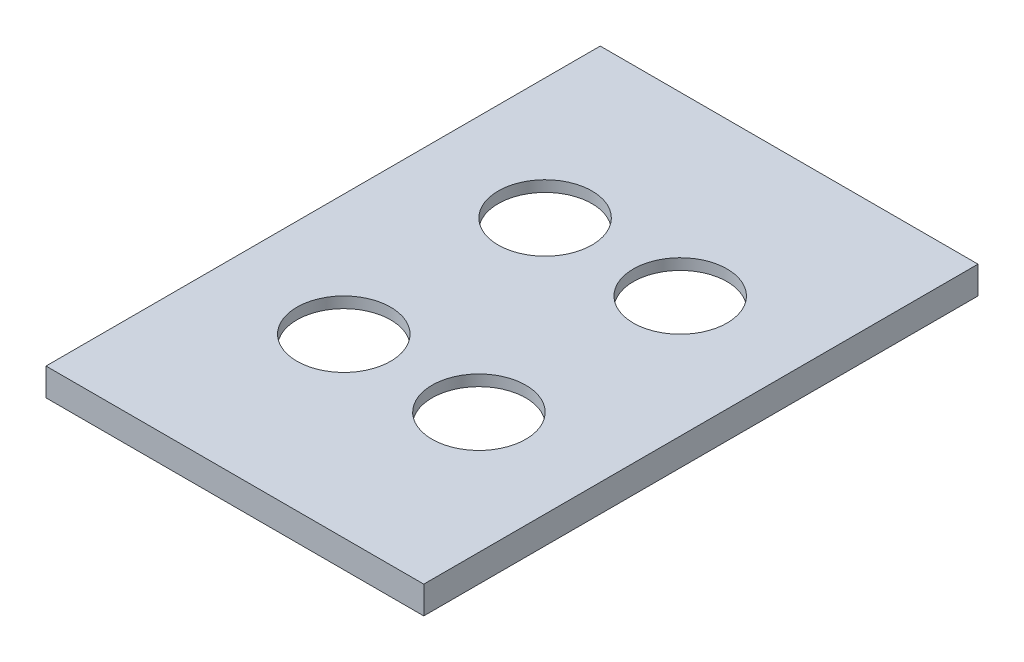
ISO-10303-21;
HEADER;
FILE_DESCRIPTION(('STEP AP214'),'2;1');
FILE_NAME('part.step','',(''),(''),'','','');
FILE_SCHEMA(('AUTOMOTIVE_DESIGN { 1 0 10303 214 1 1 1 1 }'));
ENDSEC;
DATA;
#1=APPLICATION_CONTEXT('core data for automotive mechanical design processes');
#2=APPLICATION_PROTOCOL_DEFINITION('international standard','automotive_design',2000,#1);
#3=PRODUCT_CONTEXT('',#1,'mechanical');
#4=PRODUCT('Part','Part','',(#3));
#5=PRODUCT_RELATED_PRODUCT_CATEGORY('part','',(#4));
#6=PRODUCT_DEFINITION_FORMATION('','',#4);
#7=PRODUCT_DEFINITION_CONTEXT('part definition',#1,'design');
#8=PRODUCT_DEFINITION('design','',#6,#7);
#9=PRODUCT_DEFINITION_SHAPE('','',#8);
#10=(LENGTH_UNIT() NAMED_UNIT(*) SI_UNIT(.MILLI.,.METRE.));
#11=(NAMED_UNIT(*) PLANE_ANGLE_UNIT() SI_UNIT($,.RADIAN.));
#12=(NAMED_UNIT(*) SI_UNIT($,.STERADIAN.) SOLID_ANGLE_UNIT());
#13=UNCERTAINTY_MEASURE_WITH_UNIT(LENGTH_MEASURE(1.E-05),#10,'distance_accuracy_value','');
#14=(GEOMETRIC_REPRESENTATION_CONTEXT(3) GLOBAL_UNCERTAINTY_ASSIGNED_CONTEXT((#13)) GLOBAL_UNIT_ASSIGNED_CONTEXT((#10,
#11,#12)) REPRESENTATION_CONTEXT('',''));
#15=CARTESIAN_POINT('',(0.,0.,0.));
#16=DIRECTION('',(0.,0.,1.));
#17=DIRECTION('',(1.,0.,0.));
#18=AXIS2_PLACEMENT_3D('',#15,#16,#17);
#19=CARTESIAN_POINT('',(0.,2.,0.));
#20=DIRECTION('',(0.,1.,0.));
#21=DIRECTION('',(0.,0.,1.));
#22=AXIS2_PLACEMENT_3D('',#19,#20,#21);
#23=PLANE('',#22);
#24=CARTESIAN_POINT('',(-4.5,2.,-6.99999999999998));
#25=DIRECTION('',(0.,1.,0.));
#26=DIRECTION('',(0.,0.,1.));
#27=AXIS2_PLACEMENT_3D('',#24,#25,#26);
#28=CIRCLE('',#27,8.5);
#29=CARTESIAN_POINT('',(-4.5,2.,1.50000000000002));
#30=VERTEX_POINT('',#29);
#31=EDGE_CURVE('E166',#30,#30,#28,.T.);
#32=ORIENTED_EDGE('',*,*,#31,.F.);
#33=EDGE_LOOP('',(#32));
#34=FACE_BOUND('',#33,.T.);
#35=CARTESIAN_POINT('',(20.,2.,29.5));
#36=DIRECTION('',(0.,1.,0.));
#37=DIRECTION('',(0.,0.,1.));
#38=AXIS2_PLACEMENT_3D('',#35,#36,#37);
#39=CIRCLE('',#38,8.5);
#40=CARTESIAN_POINT('',(20.,2.,38.));
#41=VERTEX_POINT('',#40);
#42=EDGE_CURVE('E178',#41,#41,#39,.T.);
#43=ORIENTED_EDGE('',*,*,#42,.F.);
#44=EDGE_LOOP('',(#43));
#45=FACE_BOUND('',#44,.T.);
#46=CARTESIAN_POINT('',(-4.5,2.,29.5));
#47=DIRECTION('',(0.,1.,0.));
#48=DIRECTION('',(0.,0.,1.));
#49=AXIS2_PLACEMENT_3D('',#46,#47,#48);
#50=CIRCLE('',#49,8.5);
#51=CARTESIAN_POINT('',(-4.5,2.,38.));
#52=VERTEX_POINT('',#51);
#53=EDGE_CURVE('E172',#52,#52,#50,.T.);
#54=ORIENTED_EDGE('',*,*,#53,.F.);
#55=EDGE_LOOP('',(#54));
#56=FACE_BOUND('',#55,.T.);
#57=CARTESIAN_POINT('',(20.,2.,-6.99999999999998));
#58=DIRECTION('',(0.,1.,0.));
#59=DIRECTION('',(0.,0.,1.));
#60=AXIS2_PLACEMENT_3D('',#57,#58,#59);
#61=CIRCLE('',#60,8.5);
#62=CARTESIAN_POINT('',(20.,2.,1.50000000000002));
#63=VERTEX_POINT('',#62);
#64=EDGE_CURVE('E160',#63,#63,#61,.T.);
#65=ORIENTED_EDGE('',*,*,#64,.F.);
#66=EDGE_LOOP('',(#65));
#67=FACE_BOUND('',#66,.T.);
#68=DIRECTION('',(1.,0.,0.));
#69=VECTOR('',#68,1.);
#70=CARTESIAN_POINT('',(-26.5,2.,-39.));
#71=LINE('',#70,#69);
#72=CARTESIAN_POINT('',(-26.5,2.,-39.));
#73=VERTEX_POINT('',#72);
#74=CARTESIAN_POINT('',(42.,2.,-39.));
#75=VERTEX_POINT('',#74);
#76=EDGE_CURVE('E136',#73,#75,#71,.T.);
#77=ORIENTED_EDGE('',*,*,#76,.F.);
#78=DIRECTION('',(0.,0.,-1.));
#79=VECTOR('',#78,1.);
#80=CARTESIAN_POINT('',(-26.5,2.,61.5));
#81=LINE('',#80,#79);
#82=CARTESIAN_POINT('',(-26.5,2.,61.5));
#83=VERTEX_POINT('',#82);
#84=EDGE_CURVE('E145',#83,#73,#81,.T.);
#85=ORIENTED_EDGE('',*,*,#84,.F.);
#86=DIRECTION('',(-1.,0.,0.));
#87=VECTOR('',#86,1.);
#88=CARTESIAN_POINT('',(42.,2.,61.5));
#89=LINE('',#88,#87);
#90=CARTESIAN_POINT('',(42.,2.,61.5));
#91=VERTEX_POINT('',#90);
#92=EDGE_CURVE('E149',#91,#83,#89,.T.);
#93=ORIENTED_EDGE('',*,*,#92,.F.);
#94=DIRECTION('',(0.,0.,1.));
#95=VECTOR('',#94,1.);
#96=CARTESIAN_POINT('',(42.,2.,-39.));
#97=LINE('',#96,#95);
#98=EDGE_CURVE('E137',#75,#91,#97,.T.);
#99=ORIENTED_EDGE('',*,*,#98,.F.);
#100=EDGE_LOOP('',(#77,#85,#93,#99));
#101=FACE_BOUND('',#100,.T.);
#102=ADVANCED_FACE('F33',(#34,#45,#56,#67,#101),#23,.T.);
#103=CARTESIAN_POINT('',(0.,0.,0.));
#104=DIRECTION('',(0.,1.,0.));
#105=DIRECTION('',(0.,0.,1.));
#106=AXIS2_PLACEMENT_3D('',#103,#104,#105);
#107=PLANE('',#106);
#108=DIRECTION('',(0.,0.,-1.));
#109=VECTOR('',#108,1.);
#110=CARTESIAN_POINT('',(40.,0.,-37.));
#111=LINE('',#110,#109);
#112=CARTESIAN_POINT('',(40.,0.,59.5));
#113=VERTEX_POINT('',#112);
#114=CARTESIAN_POINT('',(40.,0.,-37.));
#115=VERTEX_POINT('',#114);
#116=EDGE_CURVE('E48',#113,#115,#111,.T.);
#117=ORIENTED_EDGE('',*,*,#116,.F.);
#118=DIRECTION('',(1.,0.,0.));
#119=VECTOR('',#118,1.);
#120=CARTESIAN_POINT('',(-24.5,0.,59.5));
#121=LINE('',#120,#119);
#122=CARTESIAN_POINT('',(-24.5,0.,59.5));
#123=VERTEX_POINT('',#122);
#124=EDGE_CURVE('E11',#123,#113,#121,.T.);
#125=ORIENTED_EDGE('',*,*,#124,.F.);
#126=DIRECTION('',(0.,0.,1.));
#127=VECTOR('',#126,1.);
#128=CARTESIAN_POINT('',(-24.5,0.,-37.));
#129=LINE('',#128,#127);
#130=CARTESIAN_POINT('',(-24.5,0.,-37.));
#131=VERTEX_POINT('',#130);
#132=EDGE_CURVE('E41',#131,#123,#129,.T.);
#133=ORIENTED_EDGE('',*,*,#132,.F.);
#134=DIRECTION('',(-1.,0.,0.));
#135=VECTOR('',#134,1.);
#136=CARTESIAN_POINT('',(-24.5,0.,-37.));
#137=LINE('',#136,#135);
#138=EDGE_CURVE('E102',#115,#131,#137,.T.);
#139=ORIENTED_EDGE('',*,*,#138,.F.);
#140=EDGE_LOOP('',(#117,#125,#133,#139));
#141=FACE_BOUND('',#140,.T.);
#142=CARTESIAN_POINT('',(20.,0.,29.5));
#143=DIRECTION('',(0.,1.,0.));
#144=DIRECTION('',(0.,0.,1.));
#145=AXIS2_PLACEMENT_3D('',#142,#143,#144);
#146=CIRCLE('',#145,8.5);
#147=CARTESIAN_POINT('',(20.,0.,38.));
#148=VERTEX_POINT('',#147);
#149=EDGE_CURVE('E175',#148,#148,#146,.T.);
#150=ORIENTED_EDGE('',*,*,#149,.T.);
#151=EDGE_LOOP('',(#150));
#152=FACE_BOUND('',#151,.T.);
#153=CARTESIAN_POINT('',(-4.5,0.,29.5));
#154=DIRECTION('',(0.,1.,0.));
#155=DIRECTION('',(0.,0.,1.));
#156=AXIS2_PLACEMENT_3D('',#153,#154,#155);
#157=CIRCLE('',#156,8.5);
#158=CARTESIAN_POINT('',(-4.5,0.,38.));
#159=VERTEX_POINT('',#158);
#160=EDGE_CURVE('E169',#159,#159,#157,.T.);
#161=ORIENTED_EDGE('',*,*,#160,.T.);
#162=EDGE_LOOP('',(#161));
#163=FACE_BOUND('',#162,.T.);
#164=CARTESIAN_POINT('',(-4.5,0.,-6.99999999999998));
#165=DIRECTION('',(0.,1.,0.));
#166=DIRECTION('',(0.,0.,1.));
#167=AXIS2_PLACEMENT_3D('',#164,#165,#166);
#168=CIRCLE('',#167,8.5);
#169=CARTESIAN_POINT('',(-4.5,0.,1.50000000000002));
#170=VERTEX_POINT('',#169);
#171=EDGE_CURVE('E163',#170,#170,#168,.T.);
#172=ORIENTED_EDGE('',*,*,#171,.T.);
#173=EDGE_LOOP('',(#172));
#174=FACE_BOUND('',#173,.T.);
#175=CARTESIAN_POINT('',(20.,0.,-6.99999999999998));
#176=DIRECTION('',(0.,1.,0.));
#177=DIRECTION('',(0.,0.,1.));
#178=AXIS2_PLACEMENT_3D('',#175,#176,#177);
#179=CIRCLE('',#178,8.5);
#180=CARTESIAN_POINT('',(20.,0.,1.50000000000002));
#181=VERTEX_POINT('',#180);
#182=EDGE_CURVE('E104',#181,#181,#179,.T.);
#183=ORIENTED_EDGE('',*,*,#182,.T.);
#184=EDGE_LOOP('',(#183));
#185=FACE_BOUND('',#184,.T.);
#186=ADVANCED_FACE('F35',(#141,#152,#163,#174,#185),#107,.F.);
#187=CARTESIAN_POINT('',(20.,2.,29.5));
#188=DIRECTION('',(0.,-1.,0.));
#189=DIRECTION('',(0.,0.,-1.));
#190=AXIS2_PLACEMENT_3D('',#187,#188,#189);
#191=CYLINDRICAL_SURFACE('',#190,8.5);
#192=ORIENTED_EDGE('',*,*,#42,.T.);
#193=EDGE_LOOP('',(#192));
#194=FACE_BOUND('',#193,.T.);
#195=ORIENTED_EDGE('',*,*,#149,.F.);
#196=EDGE_LOOP('',(#195));
#197=FACE_BOUND('',#196,.T.);
#198=ADVANCED_FACE('F207',(#194,#197),#191,.F.);
#199=CARTESIAN_POINT('',(-4.5,2.,29.5));
#200=DIRECTION('',(0.,-1.,0.));
#201=DIRECTION('',(0.,0.,-1.));
#202=AXIS2_PLACEMENT_3D('',#199,#200,#201);
#203=CYLINDRICAL_SURFACE('',#202,8.5);
#204=ORIENTED_EDGE('',*,*,#53,.T.);
#205=EDGE_LOOP('',(#204));
#206=FACE_BOUND('',#205,.T.);
#207=ORIENTED_EDGE('',*,*,#160,.F.);
#208=EDGE_LOOP('',(#207));
#209=FACE_BOUND('',#208,.T.);
#210=ADVANCED_FACE('F213',(#206,#209),#203,.F.);
#211=CARTESIAN_POINT('',(-4.5,2.,-6.99999999999998));
#212=DIRECTION('',(0.,-1.,0.));
#213=DIRECTION('',(0.,0.,-1.));
#214=AXIS2_PLACEMENT_3D('',#211,#212,#213);
#215=CYLINDRICAL_SURFACE('',#214,8.5);
#216=ORIENTED_EDGE('',*,*,#31,.T.);
#217=EDGE_LOOP('',(#216));
#218=FACE_BOUND('',#217,.T.);
#219=ORIENTED_EDGE('',*,*,#171,.F.);
#220=EDGE_LOOP('',(#219));
#221=FACE_BOUND('',#220,.T.);
#222=ADVANCED_FACE('F217',(#218,#221),#215,.F.);
#223=CARTESIAN_POINT('',(20.,2.,-6.99999999999998));
#224=DIRECTION('',(0.,-1.,0.));
#225=DIRECTION('',(0.,0.,-1.));
#226=AXIS2_PLACEMENT_3D('',#223,#224,#225);
#227=CYLINDRICAL_SURFACE('',#226,8.5);
#228=ORIENTED_EDGE('',*,*,#64,.T.);
#229=EDGE_LOOP('',(#228));
#230=FACE_BOUND('',#229,.T.);
#231=ORIENTED_EDGE('',*,*,#182,.F.);
#232=EDGE_LOOP('',(#231));
#233=FACE_BOUND('',#232,.T.);
#234=ADVANCED_FACE('F221',(#230,#233),#227,.F.);
#235=CARTESIAN_POINT('',(-24.5,123.624421889685,59.5));
#236=DIRECTION('',(0.,0.,1.));
#237=DIRECTION('',(1.,0.,0.));
#238=AXIS2_PLACEMENT_3D('',#235,#236,#237);
#239=PLANE('',#238);
#240=DIRECTION('',(0.,-1.,0.));
#241=VECTOR('',#240,1.);
#242=CARTESIAN_POINT('',(-24.5,123.624421889685,59.5));
#243=LINE('',#242,#241);
#244=CARTESIAN_POINT('',(-24.5,-3.,59.5));
#245=VERTEX_POINT('',#244);
#246=EDGE_CURVE('E111',#123,#245,#243,.T.);
#247=ORIENTED_EDGE('',*,*,#246,.F.);
#248=ORIENTED_EDGE('',*,*,#124,.T.);
#249=DIRECTION('',(0.,-1.,0.));
#250=VECTOR('',#249,1.);
#251=CARTESIAN_POINT('',(40.,123.624421889685,59.5));
#252=LINE('',#251,#250);
#253=CARTESIAN_POINT('',(40.,-3.,59.5));
#254=VERTEX_POINT('',#253);
#255=EDGE_CURVE('E157',#113,#254,#252,.T.);
#256=ORIENTED_EDGE('',*,*,#255,.T.);
#257=DIRECTION('',(-1.,0.,0.));
#258=VECTOR('',#257,1.);
#259=CARTESIAN_POINT('',(-24.5,-3.,59.5));
#260=LINE('',#259,#258);
#261=EDGE_CURVE('E120',#254,#245,#260,.T.);
#262=ORIENTED_EDGE('',*,*,#261,.T.);
#263=EDGE_LOOP('',(#247,#248,#256,#262));
#264=FACE_BOUND('',#263,.T.);
#265=ADVANCED_FACE('F185',(#264),#239,.F.);
#266=CARTESIAN_POINT('',(-24.5,123.624421889685,-37.));
#267=DIRECTION('',(0.,0.,-1.));
#268=DIRECTION('',(-1.,0.,0.));
#269=AXIS2_PLACEMENT_3D('',#266,#267,#268);
#270=PLANE('',#269);
#271=DIRECTION('',(0.,-1.,0.));
#272=VECTOR('',#271,1.);
#273=CARTESIAN_POINT('',(40.,123.624421889685,-37.));
#274=LINE('',#273,#272);
#275=CARTESIAN_POINT('',(40.,-3.,-37.));
#276=VERTEX_POINT('',#275);
#277=EDGE_CURVE('E105',#115,#276,#274,.T.);
#278=ORIENTED_EDGE('',*,*,#277,.F.);
#279=ORIENTED_EDGE('',*,*,#138,.T.);
#280=DIRECTION('',(0.,-1.,0.));
#281=VECTOR('',#280,1.);
#282=CARTESIAN_POINT('',(-24.5,123.624421889685,-37.));
#283=LINE('',#282,#281);
#284=CARTESIAN_POINT('',(-24.5,-3.,-37.));
#285=VERTEX_POINT('',#284);
#286=EDGE_CURVE('E95',#131,#285,#283,.T.);
#287=ORIENTED_EDGE('',*,*,#286,.T.);
#288=DIRECTION('',(1.,0.,0.));
#289=VECTOR('',#288,1.);
#290=CARTESIAN_POINT('',(-24.5,-3.,-37.));
#291=LINE('',#290,#289);
#292=EDGE_CURVE('E100',#285,#276,#291,.T.);
#293=ORIENTED_EDGE('',*,*,#292,.T.);
#294=EDGE_LOOP('',(#278,#279,#287,#293));
#295=FACE_BOUND('',#294,.T.);
#296=ADVANCED_FACE('F98',(#295),#270,.F.);
#297=CARTESIAN_POINT('',(-24.5,123.624421889685,59.5));
#298=DIRECTION('',(-1.,0.,0.));
#299=DIRECTION('',(0.,0.,1.));
#300=AXIS2_PLACEMENT_3D('',#297,#298,#299);
#301=PLANE('',#300);
#302=ORIENTED_EDGE('',*,*,#286,.F.);
#303=ORIENTED_EDGE('',*,*,#132,.T.);
#304=ORIENTED_EDGE('',*,*,#246,.T.);
#305=DIRECTION('',(0.,0.,-1.));
#306=VECTOR('',#305,1.);
#307=CARTESIAN_POINT('',(-24.5,-3.,59.5));
#308=LINE('',#307,#306);
#309=EDGE_CURVE('E108',#245,#285,#308,.T.);
#310=ORIENTED_EDGE('',*,*,#309,.T.);
#311=EDGE_LOOP('',(#302,#303,#304,#310));
#312=FACE_BOUND('',#311,.T.);
#313=ADVANCED_FACE('F109',(#312),#301,.F.);
#314=CARTESIAN_POINT('',(40.,123.624421889685,59.5));
#315=DIRECTION('',(1.,0.,0.));
#316=DIRECTION('',(0.,0.,-1.));
#317=AXIS2_PLACEMENT_3D('',#314,#315,#316);
#318=PLANE('',#317);
#319=ORIENTED_EDGE('',*,*,#255,.F.);
#320=ORIENTED_EDGE('',*,*,#116,.T.);
#321=ORIENTED_EDGE('',*,*,#277,.T.);
#322=DIRECTION('',(0.,0.,1.));
#323=VECTOR('',#322,1.);
#324=CARTESIAN_POINT('',(40.,-3.,59.5));
#325=LINE('',#324,#323);
#326=EDGE_CURVE('E118',#276,#254,#325,.T.);
#327=ORIENTED_EDGE('',*,*,#326,.T.);
#328=EDGE_LOOP('',(#319,#320,#321,#327));
#329=FACE_BOUND('',#328,.T.);
#330=ADVANCED_FACE('F188',(#329),#318,.F.);
#331=CARTESIAN_POINT('',(-26.5,123.624421889685,-39.));
#332=DIRECTION('',(0.,0.,-1.));
#333=DIRECTION('',(-1.,0.,0.));
#334=AXIS2_PLACEMENT_3D('',#331,#332,#333);
#335=PLANE('',#334);
#336=DIRECTION('',(0.,-1.,0.));
#337=VECTOR('',#336,1.);
#338=CARTESIAN_POINT('',(-26.5,123.624421889685,-39.));
#339=LINE('',#338,#337);
#340=CARTESIAN_POINT('',(-26.5,-3.,-39.));
#341=VERTEX_POINT('',#340);
#342=EDGE_CURVE('E148',#73,#341,#339,.T.);
#343=ORIENTED_EDGE('',*,*,#342,.F.);
#344=ORIENTED_EDGE('',*,*,#76,.T.);
#345=DIRECTION('',(0.,-1.,0.));
#346=VECTOR('',#345,1.);
#347=CARTESIAN_POINT('',(42.,123.624421889685,-39.));
#348=LINE('',#347,#346);
#349=CARTESIAN_POINT('',(42.,-3.,-39.));
#350=VERTEX_POINT('',#349);
#351=EDGE_CURVE('E144',#75,#350,#348,.T.);
#352=ORIENTED_EDGE('',*,*,#351,.T.);
#353=DIRECTION('',(1.,0.,0.));
#354=VECTOR('',#353,1.);
#355=CARTESIAN_POINT('',(-26.5,-3.,-39.));
#356=LINE('',#355,#354);
#357=EDGE_CURVE('E124',#341,#350,#356,.T.);
#358=ORIENTED_EDGE('',*,*,#357,.F.);
#359=EDGE_LOOP('',(#343,#344,#352,#358));
#360=FACE_BOUND('',#359,.T.);
#361=ADVANCED_FACE('F190',(#360),#335,.T.);
#362=CARTESIAN_POINT('',(-26.5,123.624421889685,61.5));
#363=DIRECTION('',(-1.,0.,0.));
#364=DIRECTION('',(0.,0.,1.));
#365=AXIS2_PLACEMENT_3D('',#362,#363,#364);
#366=PLANE('',#365);
#367=DIRECTION('',(0.,-1.,0.));
#368=VECTOR('',#367,1.);
#369=CARTESIAN_POINT('',(-26.5,123.624421889685,61.5));
#370=LINE('',#369,#368);
#371=CARTESIAN_POINT('',(-26.5,-3.,61.5));
#372=VERTEX_POINT('',#371);
#373=EDGE_CURVE('E141',#83,#372,#370,.T.);
#374=ORIENTED_EDGE('',*,*,#373,.F.);
#375=ORIENTED_EDGE('',*,*,#84,.T.);
#376=ORIENTED_EDGE('',*,*,#342,.T.);
#377=DIRECTION('',(0.,0.,-1.));
#378=VECTOR('',#377,1.);
#379=CARTESIAN_POINT('',(-26.5,-3.,61.5));
#380=LINE('',#379,#378);
#381=EDGE_CURVE('E133',#372,#341,#380,.T.);
#382=ORIENTED_EDGE('',*,*,#381,.F.);
#383=EDGE_LOOP('',(#374,#375,#376,#382));
#384=FACE_BOUND('',#383,.T.);
#385=ADVANCED_FACE('F196',(#384),#366,.T.);
#386=CARTESIAN_POINT('',(42.,123.624421889685,61.5));
#387=DIRECTION('',(0.,0.,1.));
#388=DIRECTION('',(1.,0.,0.));
#389=AXIS2_PLACEMENT_3D('',#386,#387,#388);
#390=PLANE('',#389);
#391=DIRECTION('',(0.,-1.,0.));
#392=VECTOR('',#391,1.);
#393=CARTESIAN_POINT('',(42.,123.624421889685,61.5));
#394=LINE('',#393,#392);
#395=CARTESIAN_POINT('',(42.,-3.,61.5));
#396=VERTEX_POINT('',#395);
#397=EDGE_CURVE('E140',#91,#396,#394,.T.);
#398=ORIENTED_EDGE('',*,*,#397,.F.);
#399=ORIENTED_EDGE('',*,*,#92,.T.);
#400=ORIENTED_EDGE('',*,*,#373,.T.);
#401=DIRECTION('',(-1.,0.,0.));
#402=VECTOR('',#401,1.);
#403=CARTESIAN_POINT('',(42.,-3.,61.5));
#404=LINE('',#403,#402);
#405=EDGE_CURVE('E130',#396,#372,#404,.T.);
#406=ORIENTED_EDGE('',*,*,#405,.F.);
#407=EDGE_LOOP('',(#398,#399,#400,#406));
#408=FACE_BOUND('',#407,.T.);
#409=ADVANCED_FACE('F234',(#408),#390,.T.);
#410=CARTESIAN_POINT('',(42.,123.624421889685,-39.));
#411=DIRECTION('',(1.,0.,0.));
#412=DIRECTION('',(0.,0.,-1.));
#413=AXIS2_PLACEMENT_3D('',#410,#411,#412);
#414=PLANE('',#413);
#415=ORIENTED_EDGE('',*,*,#351,.F.);
#416=ORIENTED_EDGE('',*,*,#98,.T.);
#417=ORIENTED_EDGE('',*,*,#397,.T.);
#418=DIRECTION('',(0.,0.,1.));
#419=VECTOR('',#418,1.);
#420=CARTESIAN_POINT('',(42.,-3.,-39.));
#421=LINE('',#420,#419);
#422=EDGE_CURVE('E127',#350,#396,#421,.T.);
#423=ORIENTED_EDGE('',*,*,#422,.F.);
#424=EDGE_LOOP('',(#415,#416,#417,#423));
#425=FACE_BOUND('',#424,.T.);
#426=ADVANCED_FACE('F238',(#425),#414,.T.);
#427=CARTESIAN_POINT('',(0.,-3.,0.));
#428=DIRECTION('',(0.,-1.,0.));
#429=DIRECTION('',(0.,0.,-1.));
#430=AXIS2_PLACEMENT_3D('',#427,#428,#429);
#431=PLANE('',#430);
#432=ORIENTED_EDGE('',*,*,#357,.T.);
#433=ORIENTED_EDGE('',*,*,#422,.T.);
#434=ORIENTED_EDGE('',*,*,#405,.T.);
#435=ORIENTED_EDGE('',*,*,#381,.T.);
#436=EDGE_LOOP('',(#432,#433,#434,#435));
#437=FACE_BOUND('',#436,.T.);
#438=ORIENTED_EDGE('',*,*,#292,.F.);
#439=ORIENTED_EDGE('',*,*,#309,.F.);
#440=ORIENTED_EDGE('',*,*,#261,.F.);
#441=ORIENTED_EDGE('',*,*,#326,.F.);
#442=EDGE_LOOP('',(#438,#439,#440,#441));
#443=FACE_BOUND('',#442,.T.);
#444=ADVANCED_FACE('F116',(#437,#443),#431,.T.);
#445=CLOSED_SHELL('',(#102,#186,#198,#210,#222,#234,#265,#296,#313,#330,#361,#385,#409,#426,#444));
#446=MANIFOLD_SOLID_BREP('B2',#445);
#447=ADVANCED_BREP_SHAPE_REPRESENTATION('',(#18,#446),#14);
#448=SHAPE_DEFINITION_REPRESENTATION(#9,#447);
ENDSEC;
END-ISO-10303-21;
